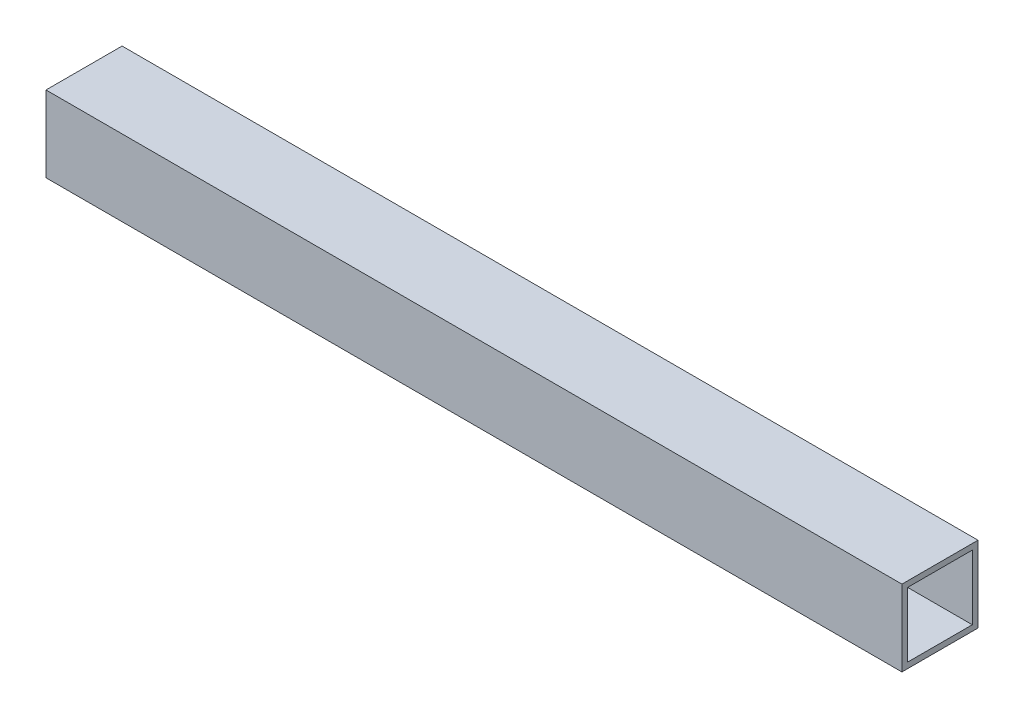
ISO-10303-21;
HEADER;
FILE_DESCRIPTION(('STEP AP214'),'2;1');
FILE_NAME('part.step','',(''),(''),'','','');
FILE_SCHEMA(('AUTOMOTIVE_DESIGN { 1 0 10303 214 1 1 1 1 }'));
ENDSEC;
DATA;
#1=APPLICATION_CONTEXT('core data for automotive mechanical design processes');
#2=APPLICATION_PROTOCOL_DEFINITION('international standard','automotive_design',2000,#1);
#3=PRODUCT_CONTEXT('',#1,'mechanical');
#4=PRODUCT('Part','Part','',(#3));
#5=PRODUCT_RELATED_PRODUCT_CATEGORY('part','',(#4));
#6=PRODUCT_DEFINITION_FORMATION('','',#4);
#7=PRODUCT_DEFINITION_CONTEXT('part definition',#1,'design');
#8=PRODUCT_DEFINITION('design','',#6,#7);
#9=PRODUCT_DEFINITION_SHAPE('','',#8);
#10=(LENGTH_UNIT() NAMED_UNIT(*) SI_UNIT(.MILLI.,.METRE.));
#11=(NAMED_UNIT(*) PLANE_ANGLE_UNIT() SI_UNIT($,.RADIAN.));
#12=(NAMED_UNIT(*) SI_UNIT($,.STERADIAN.) SOLID_ANGLE_UNIT());
#13=UNCERTAINTY_MEASURE_WITH_UNIT(LENGTH_MEASURE(1.E-05),#10,'distance_accuracy_value','');
#14=(GEOMETRIC_REPRESENTATION_CONTEXT(3) GLOBAL_UNCERTAINTY_ASSIGNED_CONTEXT((#13)) GLOBAL_UNIT_ASSIGNED_CONTEXT((#10,
#11,#12)) REPRESENTATION_CONTEXT('',''));
#15=CARTESIAN_POINT('',(0.,0.,0.));
#16=DIRECTION('',(0.,0.,1.));
#17=DIRECTION('',(1.,0.,0.));
#18=AXIS2_PLACEMENT_3D('',#15,#16,#17);
#19=CARTESIAN_POINT('',(-225.,-20.,40.));
#20=DIRECTION('',(1.,0.,0.));
#21=DIRECTION('',(0.,0.,-1.));
#22=AXIS2_PLACEMENT_3D('',#19,#20,#21);
#23=PLANE('',#22);
#24=DIRECTION('',(0.,-1.,0.));
#25=VECTOR('',#24,1.);
#26=CARTESIAN_POINT('',(-225.,17.,37.));
#27=LINE('',#26,#25);
#28=CARTESIAN_POINT('',(-225.,17.,37.));
#29=VERTEX_POINT('',#28);
#30=CARTESIAN_POINT('',(-225.,-17.,37.));
#31=VERTEX_POINT('',#30);
#32=EDGE_CURVE('E105',#29,#31,#27,.T.);
#33=ORIENTED_EDGE('',*,*,#32,.T.);
#34=DIRECTION('',(0.,0.,-1.));
#35=VECTOR('',#34,1.);
#36=CARTESIAN_POINT('',(-225.,-17.,37.));
#37=LINE('',#36,#35);
#38=CARTESIAN_POINT('',(-225.,-17.,3.));
#39=VERTEX_POINT('',#38);
#40=EDGE_CURVE('E99',#31,#39,#37,.T.);
#41=ORIENTED_EDGE('',*,*,#40,.T.);
#42=DIRECTION('',(0.,1.,0.));
#43=VECTOR('',#42,1.);
#44=CARTESIAN_POINT('',(-225.,-17.,3.));
#45=LINE('',#44,#43);
#46=CARTESIAN_POINT('',(-225.,17.,3.));
#47=VERTEX_POINT('',#46);
#48=EDGE_CURVE('E108',#39,#47,#45,.T.);
#49=ORIENTED_EDGE('',*,*,#48,.T.);
#50=DIRECTION('',(0.,0.,1.));
#51=VECTOR('',#50,1.);
#52=CARTESIAN_POINT('',(-225.,17.,3.));
#53=LINE('',#52,#51);
#54=EDGE_CURVE('E47',#47,#29,#53,.T.);
#55=ORIENTED_EDGE('',*,*,#54,.T.);
#56=EDGE_LOOP('',(#33,#41,#49,#55));
#57=FACE_BOUND('',#56,.T.);
#58=DIRECTION('',(0.,-1.,0.));
#59=VECTOR('',#58,1.);
#60=CARTESIAN_POINT('',(-225.,-20.,0.));
#61=LINE('',#60,#59);
#62=CARTESIAN_POINT('',(-225.,20.,0.));
#63=VERTEX_POINT('',#62);
#64=CARTESIAN_POINT('',(-225.,-20.,0.));
#65=VERTEX_POINT('',#64);
#66=EDGE_CURVE('E129',#63,#65,#61,.T.);
#67=ORIENTED_EDGE('',*,*,#66,.T.);
#68=DIRECTION('',(0.,0.,-1.));
#69=VECTOR('',#68,1.);
#70=CARTESIAN_POINT('',(-225.,-20.,40.));
#71=LINE('',#70,#69);
#72=CARTESIAN_POINT('',(-225.,-20.,40.));
#73=VERTEX_POINT('',#72);
#74=EDGE_CURVE('E11',#73,#65,#71,.T.);
#75=ORIENTED_EDGE('',*,*,#74,.F.);
#76=DIRECTION('',(0.,-1.,0.));
#77=VECTOR('',#76,1.);
#78=CARTESIAN_POINT('',(-225.,-20.,40.));
#79=LINE('',#78,#77);
#80=CARTESIAN_POINT('',(-225.,20.,40.));
#81=VERTEX_POINT('',#80);
#82=EDGE_CURVE('E133',#81,#73,#79,.T.);
#83=ORIENTED_EDGE('',*,*,#82,.F.);
#84=DIRECTION('',(0.,0.,-1.));
#85=VECTOR('',#84,1.);
#86=CARTESIAN_POINT('',(-225.,20.,40.));
#87=LINE('',#86,#85);
#88=EDGE_CURVE('E143',#81,#63,#87,.T.);
#89=ORIENTED_EDGE('',*,*,#88,.T.);
#90=EDGE_LOOP('',(#67,#75,#83,#89));
#91=FACE_BOUND('',#90,.T.);
#92=ADVANCED_FACE('F33',(#57,#91),#23,.F.);
#93=CARTESIAN_POINT('',(225.,-20.,40.));
#94=DIRECTION('',(0.,1.,0.));
#95=DIRECTION('',(-1.,0.,0.));
#96=AXIS2_PLACEMENT_3D('',#93,#94,#95);
#97=PLANE('',#96);
#98=DIRECTION('',(1.,0.,0.));
#99=VECTOR('',#98,1.);
#100=CARTESIAN_POINT('',(225.,-20.,0.));
#101=LINE('',#100,#99);
#102=CARTESIAN_POINT('',(225.,-20.,0.));
#103=VERTEX_POINT('',#102);
#104=EDGE_CURVE('E146',#65,#103,#101,.T.);
#105=ORIENTED_EDGE('',*,*,#104,.T.);
#106=DIRECTION('',(0.,0.,-1.));
#107=VECTOR('',#106,1.);
#108=CARTESIAN_POINT('',(225.,-20.,40.));
#109=LINE('',#108,#107);
#110=CARTESIAN_POINT('',(225.,-20.,40.));
#111=VERTEX_POINT('',#110);
#112=EDGE_CURVE('E40',#111,#103,#109,.T.);
#113=ORIENTED_EDGE('',*,*,#112,.F.);
#114=DIRECTION('',(1.,0.,0.));
#115=VECTOR('',#114,1.);
#116=CARTESIAN_POINT('',(225.,-20.,40.));
#117=LINE('',#116,#115);
#118=EDGE_CURVE('E136',#73,#111,#117,.T.);
#119=ORIENTED_EDGE('',*,*,#118,.F.);
#120=ORIENTED_EDGE('',*,*,#74,.T.);
#121=EDGE_LOOP('',(#105,#113,#119,#120));
#122=FACE_BOUND('',#121,.T.);
#123=ADVANCED_FACE('F175',(#122),#97,.F.);
#124=CARTESIAN_POINT('',(225.,-20.,40.));
#125=DIRECTION('',(-1.,0.,0.));
#126=DIRECTION('',(0.,0.,1.));
#127=AXIS2_PLACEMENT_3D('',#124,#125,#126);
#128=PLANE('',#127);
#129=DIRECTION('',(0.,1.,0.));
#130=VECTOR('',#129,1.);
#131=CARTESIAN_POINT('',(225.,-17.,3.));
#132=LINE('',#131,#130);
#133=CARTESIAN_POINT('',(225.,-17.,3.));
#134=VERTEX_POINT('',#133);
#135=CARTESIAN_POINT('',(225.,17.,3.));
#136=VERTEX_POINT('',#135);
#137=EDGE_CURVE('E123',#134,#136,#132,.T.);
#138=ORIENTED_EDGE('',*,*,#137,.F.);
#139=DIRECTION('',(0.,0.,-1.));
#140=VECTOR('',#139,1.);
#141=CARTESIAN_POINT('',(225.,-17.,37.));
#142=LINE('',#141,#140);
#143=CARTESIAN_POINT('',(225.,-17.,37.));
#144=VERTEX_POINT('',#143);
#145=EDGE_CURVE('E55',#144,#134,#142,.T.);
#146=ORIENTED_EDGE('',*,*,#145,.F.);
#147=DIRECTION('',(0.,-1.,0.));
#148=VECTOR('',#147,1.);
#149=CARTESIAN_POINT('',(225.,17.,37.));
#150=LINE('',#149,#148);
#151=CARTESIAN_POINT('',(225.,17.,37.));
#152=VERTEX_POINT('',#151);
#153=EDGE_CURVE('E114',#152,#144,#150,.T.);
#154=ORIENTED_EDGE('',*,*,#153,.F.);
#155=DIRECTION('',(0.,0.,1.));
#156=VECTOR('',#155,1.);
#157=CARTESIAN_POINT('',(225.,17.,3.));
#158=LINE('',#157,#156);
#159=EDGE_CURVE('E117',#136,#152,#158,.T.);
#160=ORIENTED_EDGE('',*,*,#159,.F.);
#161=EDGE_LOOP('',(#138,#146,#154,#160));
#162=FACE_BOUND('',#161,.T.);
#163=DIRECTION('',(0.,1.,0.));
#164=VECTOR('',#163,1.);
#165=CARTESIAN_POINT('',(225.,-20.,0.));
#166=LINE('',#165,#164);
#167=CARTESIAN_POINT('',(225.,20.,0.));
#168=VERTEX_POINT('',#167);
#169=EDGE_CURVE('E148',#103,#168,#166,.T.);
#170=ORIENTED_EDGE('',*,*,#169,.T.);
#171=DIRECTION('',(0.,0.,-1.));
#172=VECTOR('',#171,1.);
#173=CARTESIAN_POINT('',(225.,20.,40.));
#174=LINE('',#173,#172);
#175=CARTESIAN_POINT('',(225.,20.,40.));
#176=VERTEX_POINT('',#175);
#177=EDGE_CURVE('E153',#176,#168,#174,.T.);
#178=ORIENTED_EDGE('',*,*,#177,.F.);
#179=DIRECTION('',(0.,1.,0.));
#180=VECTOR('',#179,1.);
#181=CARTESIAN_POINT('',(225.,-20.,40.));
#182=LINE('',#181,#180);
#183=EDGE_CURVE('E139',#111,#176,#182,.T.);
#184=ORIENTED_EDGE('',*,*,#183,.F.);
#185=ORIENTED_EDGE('',*,*,#112,.T.);
#186=EDGE_LOOP('',(#170,#178,#184,#185));
#187=FACE_BOUND('',#186,.T.);
#188=ADVANCED_FACE('F160',(#162,#187),#128,.F.);
#189=CARTESIAN_POINT('',(225.,20.,40.));
#190=DIRECTION('',(0.,-1.,0.));
#191=DIRECTION('',(1.,0.,0.));
#192=AXIS2_PLACEMENT_3D('',#189,#190,#191);
#193=PLANE('',#192);
#194=DIRECTION('',(-1.,0.,0.));
#195=VECTOR('',#194,1.);
#196=CARTESIAN_POINT('',(225.,20.,0.));
#197=LINE('',#196,#195);
#198=EDGE_CURVE('E137',#168,#63,#197,.T.);
#199=ORIENTED_EDGE('',*,*,#198,.T.);
#200=ORIENTED_EDGE('',*,*,#88,.F.);
#201=DIRECTION('',(-1.,0.,0.));
#202=VECTOR('',#201,1.);
#203=CARTESIAN_POINT('',(225.,20.,40.));
#204=LINE('',#203,#202);
#205=EDGE_CURVE('E141',#176,#81,#204,.T.);
#206=ORIENTED_EDGE('',*,*,#205,.F.);
#207=ORIENTED_EDGE('',*,*,#177,.T.);
#208=EDGE_LOOP('',(#199,#200,#206,#207));
#209=FACE_BOUND('',#208,.T.);
#210=ADVANCED_FACE('F169',(#209),#193,.F.);
#211=CARTESIAN_POINT('',(0.,0.,40.));
#212=DIRECTION('',(0.,0.,1.));
#213=DIRECTION('',(1.,0.,0.));
#214=AXIS2_PLACEMENT_3D('',#211,#212,#213);
#215=PLANE('',#214);
#216=ORIENTED_EDGE('',*,*,#82,.T.);
#217=ORIENTED_EDGE('',*,*,#118,.T.);
#218=ORIENTED_EDGE('',*,*,#183,.T.);
#219=ORIENTED_EDGE('',*,*,#205,.T.);
#220=EDGE_LOOP('',(#216,#217,#218,#219));
#221=FACE_BOUND('',#220,.T.);
#222=ADVANCED_FACE('F174',(#221),#215,.T.);
#223=CARTESIAN_POINT('',(0.,0.,0.));
#224=DIRECTION('',(0.,0.,1.));
#225=DIRECTION('',(1.,0.,0.));
#226=AXIS2_PLACEMENT_3D('',#223,#224,#225);
#227=PLANE('',#226);
#228=ORIENTED_EDGE('',*,*,#66,.F.);
#229=ORIENTED_EDGE('',*,*,#198,.F.);
#230=ORIENTED_EDGE('',*,*,#169,.F.);
#231=ORIENTED_EDGE('',*,*,#104,.F.);
#232=EDGE_LOOP('',(#228,#229,#230,#231));
#233=FACE_BOUND('',#232,.T.);
#234=ADVANCED_FACE('F166',(#233),#227,.F.);
#235=CARTESIAN_POINT('',(-225.,-17.,37.));
#236=DIRECTION('',(0.,-1.,0.));
#237=DIRECTION('',(0.,0.,-1.));
#238=AXIS2_PLACEMENT_3D('',#235,#236,#237);
#239=PLANE('',#238);
#240=ORIENTED_EDGE('',*,*,#145,.T.);
#241=DIRECTION('',(1.,0.,0.));
#242=VECTOR('',#241,1.);
#243=CARTESIAN_POINT('',(-225.,-17.,3.));
#244=LINE('',#243,#242);
#245=EDGE_CURVE('E95',#39,#134,#244,.T.);
#246=ORIENTED_EDGE('',*,*,#245,.F.);
#247=ORIENTED_EDGE('',*,*,#40,.F.);
#248=DIRECTION('',(1.,0.,0.));
#249=VECTOR('',#248,1.);
#250=CARTESIAN_POINT('',(-225.,-17.,37.));
#251=LINE('',#250,#249);
#252=EDGE_CURVE('E127',#31,#144,#251,.T.);
#253=ORIENTED_EDGE('',*,*,#252,.T.);
#254=EDGE_LOOP('',(#240,#246,#247,#253));
#255=FACE_BOUND('',#254,.T.);
#256=ADVANCED_FACE('F97',(#255),#239,.F.);
#257=CARTESIAN_POINT('',(-225.,17.,37.));
#258=DIRECTION('',(0.,0.,1.));
#259=DIRECTION('',(1.,0.,0.));
#260=AXIS2_PLACEMENT_3D('',#257,#258,#259);
#261=PLANE('',#260);
#262=ORIENTED_EDGE('',*,*,#153,.T.);
#263=ORIENTED_EDGE('',*,*,#252,.F.);
#264=ORIENTED_EDGE('',*,*,#32,.F.);
#265=DIRECTION('',(1.,0.,0.));
#266=VECTOR('',#265,1.);
#267=CARTESIAN_POINT('',(-225.,17.,37.));
#268=LINE('',#267,#266);
#269=EDGE_CURVE('E130',#29,#152,#268,.T.);
#270=ORIENTED_EDGE('',*,*,#269,.T.);
#271=EDGE_LOOP('',(#262,#263,#264,#270));
#272=FACE_BOUND('',#271,.T.);
#273=ADVANCED_FACE('F192',(#272),#261,.F.);
#274=CARTESIAN_POINT('',(-225.,17.,3.));
#275=DIRECTION('',(0.,1.,0.));
#276=DIRECTION('',(0.,0.,1.));
#277=AXIS2_PLACEMENT_3D('',#274,#275,#276);
#278=PLANE('',#277);
#279=ORIENTED_EDGE('',*,*,#159,.T.);
#280=ORIENTED_EDGE('',*,*,#269,.F.);
#281=ORIENTED_EDGE('',*,*,#54,.F.);
#282=DIRECTION('',(1.,0.,0.));
#283=VECTOR('',#282,1.);
#284=CARTESIAN_POINT('',(-225.,17.,3.));
#285=LINE('',#284,#283);
#286=EDGE_CURVE('E104',#47,#136,#285,.T.);
#287=ORIENTED_EDGE('',*,*,#286,.T.);
#288=EDGE_LOOP('',(#279,#280,#281,#287));
#289=FACE_BOUND('',#288,.T.);
#290=ADVANCED_FACE('F195',(#289),#278,.F.);
#291=CARTESIAN_POINT('',(-225.,-17.,3.));
#292=DIRECTION('',(0.,0.,-1.));
#293=DIRECTION('',(-1.,0.,0.));
#294=AXIS2_PLACEMENT_3D('',#291,#292,#293);
#295=PLANE('',#294);
#296=ORIENTED_EDGE('',*,*,#137,.T.);
#297=ORIENTED_EDGE('',*,*,#286,.F.);
#298=ORIENTED_EDGE('',*,*,#48,.F.);
#299=ORIENTED_EDGE('',*,*,#245,.T.);
#300=EDGE_LOOP('',(#296,#297,#298,#299));
#301=FACE_BOUND('',#300,.T.);
#302=ADVANCED_FACE('F109',(#301),#295,.F.);
#303=CLOSED_SHELL('',(#92,#123,#188,#210,#222,#234,#256,#273,#290,#302));
#304=MANIFOLD_SOLID_BREP('B2',#303);
#305=ADVANCED_BREP_SHAPE_REPRESENTATION('',(#18,#304),#14);
#306=SHAPE_DEFINITION_REPRESENTATION(#9,#305);
ENDSEC;
END-ISO-10303-21;
